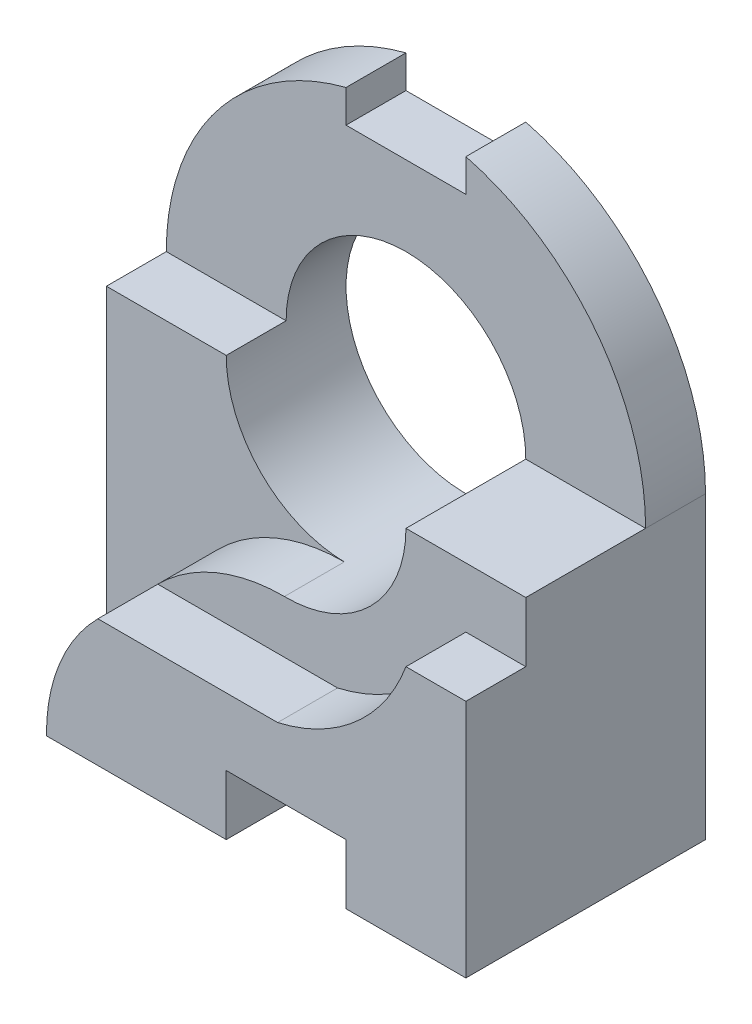
ISO-10303-21;
HEADER;
FILE_DESCRIPTION(('STEP AP214'),'2;1');
FILE_NAME('part.step','',(''),(''),'','','');
FILE_SCHEMA(('AUTOMOTIVE_DESIGN { 1 0 10303 214 1 1 1 1 }'));
ENDSEC;
DATA;
#1=APPLICATION_CONTEXT('core data for automotive mechanical design processes');
#2=APPLICATION_PROTOCOL_DEFINITION('international standard','automotive_design',2000,#1);
#3=PRODUCT_CONTEXT('',#1,'mechanical');
#4=PRODUCT('Part','Part','',(#3));
#5=PRODUCT_RELATED_PRODUCT_CATEGORY('part','',(#4));
#6=PRODUCT_DEFINITION_FORMATION('','',#4);
#7=PRODUCT_DEFINITION_CONTEXT('part definition',#1,'design');
#8=PRODUCT_DEFINITION('design','',#6,#7);
#9=PRODUCT_DEFINITION_SHAPE('','',#8);
#10=(LENGTH_UNIT() NAMED_UNIT(*) SI_UNIT(.MILLI.,.METRE.));
#11=(NAMED_UNIT(*) PLANE_ANGLE_UNIT() SI_UNIT($,.RADIAN.));
#12=(NAMED_UNIT(*) SI_UNIT($,.STERADIAN.) SOLID_ANGLE_UNIT());
#13=UNCERTAINTY_MEASURE_WITH_UNIT(LENGTH_MEASURE(1.E-05),#10,'distance_accuracy_value','');
#14=(GEOMETRIC_REPRESENTATION_CONTEXT(3) GLOBAL_UNCERTAINTY_ASSIGNED_CONTEXT((#13)) GLOBAL_UNIT_ASSIGNED_CONTEXT((#10,
#11,#12)) REPRESENTATION_CONTEXT('',''));
#15=CARTESIAN_POINT('',(0.,0.,0.));
#16=DIRECTION('',(0.,0.,1.));
#17=DIRECTION('',(1.,0.,0.));
#18=AXIS2_PLACEMENT_3D('',#15,#16,#17);
#19=CARTESIAN_POINT('',(0.,0.,4.));
#20=DIRECTION('',(0.,0.,-1.));
#21=DIRECTION('',(-1.,0.,0.));
#22=AXIS2_PLACEMENT_3D('',#19,#20,#21);
#23=CYLINDRICAL_SURFACE('',#22,2.);
#24=CARTESIAN_POINT('',(0.,0.,0.));
#25=DIRECTION('',(0.,0.,1.));
#26=DIRECTION('',(1.,0.,0.));
#27=AXIS2_PLACEMENT_3D('',#24,#25,#26);
#28=CIRCLE('',#27,2.);
#29=CARTESIAN_POINT('',(2.,0.,0.));
#30=VERTEX_POINT('',#29);
#31=EDGE_CURVE('E294',#30,#30,#28,.T.);
#32=ORIENTED_EDGE('',*,*,#31,.F.);
#33=EDGE_LOOP('',(#32));
#34=FACE_BOUND('',#33,.T.);
#35=DIRECTION('',(0.,0.,1.));
#36=VECTOR('',#35,1.);
#37=CARTESIAN_POINT('',(-0.0288487824081157,-1.99979192611471,2.));
#38=LINE('',#37,#36);
#39=CARTESIAN_POINT('',(-0.0288487824081157,-1.99979192611471,2.));
#40=VERTEX_POINT('',#39);
#41=CARTESIAN_POINT('',(-0.0288487824081157,-1.99979192611471,3.));
#42=VERTEX_POINT('',#41);
#43=EDGE_CURVE('E229',#40,#42,#38,.T.);
#44=ORIENTED_EDGE('',*,*,#43,.T.);
#45=CARTESIAN_POINT('',(0.,0.,3.));
#46=DIRECTION('',(0.,0.,1.));
#47=DIRECTION('',(1.,0.,0.));
#48=AXIS2_PLACEMENT_3D('',#45,#46,#47);
#49=CIRCLE('',#48,2.);
#50=CARTESIAN_POINT('',(2.,0.,3.));
#51=VERTEX_POINT('',#50);
#52=EDGE_CURVE('E48',#51,#42,#49,.F.);
#53=ORIENTED_EDGE('',*,*,#52,.F.);
#54=DIRECTION('',(0.,0.,-1.));
#55=VECTOR('',#54,1.);
#56=CARTESIAN_POINT('',(2.,0.,4.));
#57=LINE('',#56,#55);
#58=CARTESIAN_POINT('',(2.,0.,1.));
#59=VERTEX_POINT('',#58);
#60=EDGE_CURVE('E41',#59,#51,#57,.F.);
#61=ORIENTED_EDGE('',*,*,#60,.F.);
#62=CARTESIAN_POINT('',(0.,0.,1.));
#63=DIRECTION('',(0.,0.,-1.));
#64=DIRECTION('',(-1.,0.,0.));
#65=AXIS2_PLACEMENT_3D('',#62,#63,#64);
#66=CIRCLE('',#65,2.);
#67=CARTESIAN_POINT('',(-2.,0.,1.));
#68=VERTEX_POINT('',#67);
#69=EDGE_CURVE('E249',#68,#59,#66,.T.);
#70=ORIENTED_EDGE('',*,*,#69,.F.);
#71=DIRECTION('',(0.,0.,-1.));
#72=VECTOR('',#71,1.);
#73=CARTESIAN_POINT('',(-2.,0.,4.));
#74=LINE('',#73,#72);
#75=CARTESIAN_POINT('',(-2.,0.,2.));
#76=VERTEX_POINT('',#75);
#77=EDGE_CURVE('E11',#76,#68,#74,.T.);
#78=ORIENTED_EDGE('',*,*,#77,.F.);
#79=CARTESIAN_POINT('',(0.,0.,2.));
#80=DIRECTION('',(0.,0.,1.));
#81=DIRECTION('',(1.,0.,0.));
#82=AXIS2_PLACEMENT_3D('',#79,#80,#81);
#83=CIRCLE('',#82,2.);
#84=EDGE_CURVE('E56',#40,#76,#83,.F.);
#85=ORIENTED_EDGE('',*,*,#84,.F.);
#86=EDGE_LOOP('',(#44,#53,#61,#70,#78,#85));
#87=FACE_BOUND('',#86,.T.);
#88=ADVANCED_FACE('F33',(#34,#87),#23,.F.);
#89=CARTESIAN_POINT('',(4.,-5.,4.));
#90=DIRECTION('',(-1.,0.,0.));
#91=DIRECTION('',(0.,0.,1.));
#92=AXIS2_PLACEMENT_3D('',#89,#90,#91);
#93=PLANE('',#92);
#94=DIRECTION('',(0.,0.,1.));
#95=VECTOR('',#94,1.);
#96=CARTESIAN_POINT('',(4.,-1.,3.));
#97=LINE('',#96,#95);
#98=CARTESIAN_POINT('',(4.,-1.,3.));
#99=VERTEX_POINT('',#98);
#100=CARTESIAN_POINT('',(4.,-1.,4.));
#101=VERTEX_POINT('',#100);
#102=EDGE_CURVE('E181',#99,#101,#97,.T.);
#103=ORIENTED_EDGE('',*,*,#102,.T.);
#104=DIRECTION('',(0.,1.,0.));
#105=VECTOR('',#104,1.);
#106=CARTESIAN_POINT('',(4.,-5.,4.));
#107=LINE('',#106,#105);
#108=CARTESIAN_POINT('',(4.,-5.,4.));
#109=VERTEX_POINT('',#108);
#110=EDGE_CURVE('E303',#109,#101,#107,.T.);
#111=ORIENTED_EDGE('',*,*,#110,.F.);
#112=DIRECTION('',(0.,0.,-1.));
#113=VECTOR('',#112,1.);
#114=CARTESIAN_POINT('',(4.,-5.,4.));
#115=LINE('',#114,#113);
#116=CARTESIAN_POINT('',(4.,-5.,0.));
#117=VERTEX_POINT('',#116);
#118=EDGE_CURVE('E310',#109,#117,#115,.T.);
#119=ORIENTED_EDGE('',*,*,#118,.T.);
#120=DIRECTION('',(0.,1.,0.));
#121=VECTOR('',#120,1.);
#122=CARTESIAN_POINT('',(4.,-5.,0.));
#123=LINE('',#122,#121);
#124=CARTESIAN_POINT('',(4.,0.,0.));
#125=VERTEX_POINT('',#124);
#126=EDGE_CURVE('E302',#117,#125,#123,.T.);
#127=ORIENTED_EDGE('',*,*,#126,.T.);
#128=DIRECTION('',(0.,0.,-1.));
#129=VECTOR('',#128,1.);
#130=CARTESIAN_POINT('',(4.,0.,4.));
#131=LINE('',#130,#129);
#132=CARTESIAN_POINT('',(4.,0.,1.));
#133=VERTEX_POINT('',#132);
#134=EDGE_CURVE('E330',#133,#125,#131,.T.);
#135=ORIENTED_EDGE('',*,*,#134,.F.);
#136=CARTESIAN_POINT('',(4.,0.,3.));
#137=VERTEX_POINT('',#136);
#138=EDGE_CURVE('E331',#137,#133,#131,.T.);
#139=ORIENTED_EDGE('',*,*,#138,.F.);
#140=DIRECTION('',(0.,1.,0.));
#141=VECTOR('',#140,1.);
#142=CARTESIAN_POINT('',(4.,0.,3.));
#143=LINE('',#142,#141);
#144=EDGE_CURVE('E184',#99,#137,#143,.T.);
#145=ORIENTED_EDGE('',*,*,#144,.F.);
#146=EDGE_LOOP('',(#103,#111,#119,#127,#135,#139,#145));
#147=FACE_BOUND('',#146,.T.);
#148=ADVANCED_FACE('F35',(#147),#93,.F.);
#149=CARTESIAN_POINT('',(4.,0.,1.));
#150=DIRECTION('',(0.,-1.,0.));
#151=DIRECTION('',(1.,0.,0.));
#152=AXIS2_PLACEMENT_3D('',#149,#150,#151);
#153=PLANE('',#152);
#154=DIRECTION('',(-1.,0.,0.));
#155=VECTOR('',#154,1.);
#156=CARTESIAN_POINT('',(0.,0.,3.));
#157=LINE('',#156,#155);
#158=EDGE_CURVE('E205',#137,#51,#157,.T.);
#159=ORIENTED_EDGE('',*,*,#158,.F.);
#160=ORIENTED_EDGE('',*,*,#138,.T.);
#161=DIRECTION('',(1.,0.,0.));
#162=VECTOR('',#161,1.);
#163=CARTESIAN_POINT('',(4.,0.,1.));
#164=LINE('',#163,#162);
#165=EDGE_CURVE('E239',#59,#133,#164,.T.);
#166=ORIENTED_EDGE('',*,*,#165,.F.);
#167=ORIENTED_EDGE('',*,*,#60,.T.);
#168=EDGE_LOOP('',(#159,#160,#166,#167));
#169=FACE_BOUND('',#168,.T.);
#170=ADVANCED_FACE('F340',(#169),#153,.F.);
#171=CARTESIAN_POINT('',(4.,-5.,4.));
#172=DIRECTION('',(0.,1.,0.));
#173=DIRECTION('',(-1.,0.,0.));
#174=AXIS2_PLACEMENT_3D('',#171,#172,#173);
#175=PLANE('',#174);
#176=DIRECTION('',(0.,0.,1.));
#177=VECTOR('',#176,1.);
#178=CARTESIAN_POINT('',(-3.,-5.,2.));
#179=LINE('',#178,#177);
#180=CARTESIAN_POINT('',(-3.,-5.,2.));
#181=VERTEX_POINT('',#180);
#182=CARTESIAN_POINT('',(-3.,-5.,4.));
#183=VERTEX_POINT('',#182);
#184=EDGE_CURVE('E231',#181,#183,#179,.T.);
#185=ORIENTED_EDGE('',*,*,#184,.F.);
#186=DIRECTION('',(1.,0.,0.));
#187=VECTOR('',#186,1.);
#188=CARTESIAN_POINT('',(0.,-5.,2.));
#189=LINE('',#188,#187);
#190=CARTESIAN_POINT('',(-4.,-5.,2.));
#191=VERTEX_POINT('',#190);
#192=EDGE_CURVE('E226',#191,#181,#189,.T.);
#193=ORIENTED_EDGE('',*,*,#192,.F.);
#194=DIRECTION('',(0.,0.,-1.));
#195=VECTOR('',#194,1.);
#196=CARTESIAN_POINT('',(-4.,-5.,4.));
#197=LINE('',#196,#195);
#198=CARTESIAN_POINT('',(-4.,-5.,0.));
#199=VERTEX_POINT('',#198);
#200=EDGE_CURVE('E325',#191,#199,#197,.T.);
#201=ORIENTED_EDGE('',*,*,#200,.T.);
#202=DIRECTION('',(1.,0.,0.));
#203=VECTOR('',#202,1.);
#204=CARTESIAN_POINT('',(4.,-5.,0.));
#205=LINE('',#204,#203);
#206=CARTESIAN_POINT('',(0.,-5.,0.));
#207=VERTEX_POINT('',#206);
#208=EDGE_CURVE('E307',#199,#207,#205,.T.);
#209=ORIENTED_EDGE('',*,*,#208,.T.);
#210=DIRECTION('',(0.,0.,1.));
#211=VECTOR('',#210,1.);
#212=CARTESIAN_POINT('',(0.,-5.,0.));
#213=LINE('',#212,#211);
#214=CARTESIAN_POINT('',(0.,-5.,4.));
#215=VERTEX_POINT('',#214);
#216=EDGE_CURVE('E291',#207,#215,#213,.T.);
#217=ORIENTED_EDGE('',*,*,#216,.T.);
#218=DIRECTION('',(1.,0.,0.));
#219=VECTOR('',#218,1.);
#220=CARTESIAN_POINT('',(4.,-5.,4.));
#221=LINE('',#220,#219);
#222=EDGE_CURVE('E308',#183,#215,#221,.T.);
#223=ORIENTED_EDGE('',*,*,#222,.F.);
#224=EDGE_LOOP('',(#185,#193,#201,#209,#217,#223));
#225=FACE_BOUND('',#224,.T.);
#226=ADVANCED_FACE('F356',(#225),#175,.F.);
#227=CARTESIAN_POINT('',(0.,0.,4.));
#228=DIRECTION('',(0.,0.,-1.));
#229=DIRECTION('',(-1.,0.,0.));
#230=AXIS2_PLACEMENT_3D('',#227,#228,#229);
#231=PLANE('',#230);
#232=CARTESIAN_POINT('',(0.188280895426578,0.0460572054036203,4.));
#233=DIRECTION('',(0.,0.,1.));
#234=DIRECTION('',(1.,0.,0.));
#235=AXIS2_PLACEMENT_3D('',#232,#233,#234);
#236=CIRCLE('',#235,3.);
#237=CARTESIAN_POINT('',(3.,-1.,4.));
#238=VERTEX_POINT('',#237);
#239=CARTESIAN_POINT('',(0.85786479395321,-2.87826449421048,4.));
#240=VERTEX_POINT('',#239);
#241=EDGE_CURVE('E191',#238,#240,#236,.F.);
#242=ORIENTED_EDGE('',*,*,#241,.T.);
#243=DIRECTION('',(1.,0.,0.));
#244=VECTOR('',#243,1.);
#245=CARTESIAN_POINT('',(0.,-2.87826449421048,4.));
#246=LINE('',#245,#244);
#247=CARTESIAN_POINT('',(-2.14213520604679,-2.87826449421048,4.));
#248=VERTEX_POINT('',#247);
#249=EDGE_CURVE('E198',#248,#240,#246,.T.);
#250=ORIENTED_EDGE('',*,*,#249,.F.);
#251=CARTESIAN_POINT('',(-0.0358046106557674,-4.96419538934423,4.));
#252=DIRECTION('',(0.,0.,1.));
#253=DIRECTION('',(1.,0.,0.));
#254=AXIS2_PLACEMENT_3D('',#251,#252,#253);
#255=CIRCLE('',#254,2.96441162397428);
#256=EDGE_CURVE('E215',#248,#183,#255,.T.);
#257=ORIENTED_EDGE('',*,*,#256,.T.);
#258=ORIENTED_EDGE('',*,*,#222,.T.);
#259=DIRECTION('',(0.,-1.,0.));
#260=VECTOR('',#259,1.);
#261=CARTESIAN_POINT('',(0.,-4.,4.));
#262=LINE('',#261,#260);
#263=CARTESIAN_POINT('',(0.,-4.,4.));
#264=VERTEX_POINT('',#263);
#265=EDGE_CURVE('E277',#264,#215,#262,.T.);
#266=ORIENTED_EDGE('',*,*,#265,.F.);
#267=DIRECTION('',(-1.,0.,0.));
#268=VECTOR('',#267,1.);
#269=CARTESIAN_POINT('',(2.,-4.,4.));
#270=LINE('',#269,#268);
#271=CARTESIAN_POINT('',(2.,-4.,4.));
#272=VERTEX_POINT('',#271);
#273=EDGE_CURVE('E286',#272,#264,#270,.T.);
#274=ORIENTED_EDGE('',*,*,#273,.F.);
#275=DIRECTION('',(0.,1.,0.));
#276=VECTOR('',#275,1.);
#277=CARTESIAN_POINT('',(2.,-5.,4.));
#278=LINE('',#277,#276);
#279=CARTESIAN_POINT('',(2.,-5.,4.));
#280=VERTEX_POINT('',#279);
#281=EDGE_CURVE('E264',#280,#272,#278,.T.);
#282=ORIENTED_EDGE('',*,*,#281,.F.);
#283=EDGE_CURVE('E306',#280,#109,#221,.T.);
#284=ORIENTED_EDGE('',*,*,#283,.T.);
#285=ORIENTED_EDGE('',*,*,#110,.T.);
#286=DIRECTION('',(-1.,0.,0.));
#287=VECTOR('',#286,1.);
#288=CARTESIAN_POINT('',(0.,-0.999999999999999,4.));
#289=LINE('',#288,#287);
#290=EDGE_CURVE('E201',#101,#238,#289,.T.);
#291=ORIENTED_EDGE('',*,*,#290,.T.);
#292=EDGE_LOOP('',(#242,#250,#257,#258,#266,#274,#282,#284,#285,#291));
#293=FACE_BOUND('',#292,.T.);
#294=ADVANCED_FACE('F360',(#293),#231,.F.);
#295=CARTESIAN_POINT('',(-4.,-5.,4.));
#296=DIRECTION('',(1.,0.,0.));
#297=DIRECTION('',(0.,0.,-1.));
#298=AXIS2_PLACEMENT_3D('',#295,#296,#297);
#299=PLANE('',#298);
#300=DIRECTION('',(0.,-1.,0.));
#301=VECTOR('',#300,1.);
#302=CARTESIAN_POINT('',(-4.,0.,2.));
#303=LINE('',#302,#301);
#304=CARTESIAN_POINT('',(-4.,0.,2.));
#305=VERTEX_POINT('',#304);
#306=EDGE_CURVE('E224',#305,#191,#303,.T.);
#307=ORIENTED_EDGE('',*,*,#306,.F.);
#308=DIRECTION('',(0.,0.,-1.));
#309=VECTOR('',#308,1.);
#310=CARTESIAN_POINT('',(-4.,0.,4.));
#311=LINE('',#310,#309);
#312=CARTESIAN_POINT('',(-4.,0.,1.));
#313=VERTEX_POINT('',#312);
#314=EDGE_CURVE('E328',#305,#313,#311,.T.);
#315=ORIENTED_EDGE('',*,*,#314,.T.);
#316=CARTESIAN_POINT('',(-4.,0.,0.));
#317=VERTEX_POINT('',#316);
#318=EDGE_CURVE('E327',#313,#317,#311,.T.);
#319=ORIENTED_EDGE('',*,*,#318,.T.);
#320=DIRECTION('',(0.,-1.,0.));
#321=VECTOR('',#320,1.);
#322=CARTESIAN_POINT('',(-4.,-5.,0.));
#323=LINE('',#322,#321);
#324=EDGE_CURVE('E317',#317,#199,#323,.T.);
#325=ORIENTED_EDGE('',*,*,#324,.T.);
#326=ORIENTED_EDGE('',*,*,#200,.F.);
#327=EDGE_LOOP('',(#307,#315,#319,#325,#326));
#328=FACE_BOUND('',#327,.T.);
#329=ADVANCED_FACE('F387',(#328),#299,.F.);
#330=DIRECTION('',(-1.,0.,0.));
#331=VECTOR('',#330,1.);
#332=CARTESIAN_POINT('',(0.,0.,2.));
#333=LINE('',#332,#331);
#334=EDGE_CURVE('E222',#76,#305,#333,.T.);
#335=ORIENTED_EDGE('',*,*,#334,.F.);
#336=ORIENTED_EDGE('',*,*,#77,.T.);
#337=EDGE_CURVE('E240',#313,#68,#164,.T.);
#338=ORIENTED_EDGE('',*,*,#337,.F.);
#339=ORIENTED_EDGE('',*,*,#314,.F.);
#340=EDGE_LOOP('',(#335,#336,#338,#339));
#341=FACE_BOUND('',#340,.T.);
#342=ADVANCED_FACE('F400',(#341),#153,.F.);
#343=CARTESIAN_POINT('',(0.,0.,4.));
#344=DIRECTION('',(0.,0.,-1.));
#345=DIRECTION('',(-1.,0.,0.));
#346=AXIS2_PLACEMENT_3D('',#343,#344,#345);
#347=CYLINDRICAL_SURFACE('',#346,4.);
#348=DIRECTION('',(0.,0.,1.));
#349=VECTOR('',#348,1.);
#350=CARTESIAN_POINT('',(1.,3.87298334620742,0.));
#351=LINE('',#350,#349);
#352=CARTESIAN_POINT('',(1.,3.87298334620742,0.));
#353=VERTEX_POINT('',#352);
#354=CARTESIAN_POINT('',(1.,3.87298334620742,1.));
#355=VERTEX_POINT('',#354);
#356=EDGE_CURVE('E260',#353,#355,#351,.T.);
#357=ORIENTED_EDGE('',*,*,#356,.T.);
#358=CARTESIAN_POINT('',(0.,0.,1.));
#359=DIRECTION('',(0.,0.,1.));
#360=DIRECTION('',(-1.,0.,0.));
#361=AXIS2_PLACEMENT_3D('',#358,#359,#360);
#362=CIRCLE('',#361,4.);
#363=EDGE_CURVE('E237',#133,#355,#362,.T.);
#364=ORIENTED_EDGE('',*,*,#363,.F.);
#365=ORIENTED_EDGE('',*,*,#134,.T.);
#366=CARTESIAN_POINT('',(0.,0.,0.));
#367=DIRECTION('',(0.,0.,1.));
#368=DIRECTION('',(-1.,0.,0.));
#369=AXIS2_PLACEMENT_3D('',#366,#367,#368);
#370=CIRCLE('',#369,4.);
#371=EDGE_CURVE('E314',#125,#353,#370,.T.);
#372=ORIENTED_EDGE('',*,*,#371,.T.);
#373=EDGE_LOOP('',(#357,#364,#365,#372));
#374=FACE_BOUND('',#373,.T.);
#375=ADVANCED_FACE('F392',(#374),#347,.T.);
#376=CARTESIAN_POINT('',(0.,0.,0.));
#377=DIRECTION('',(0.,0.,-1.));
#378=DIRECTION('',(-1.,0.,0.));
#379=AXIS2_PLACEMENT_3D('',#376,#377,#378);
#380=PLANE('',#379);
#381=DIRECTION('',(0.,1.,0.));
#382=VECTOR('',#381,1.);
#383=CARTESIAN_POINT('',(1.,3.3278264315435,0.));
#384=LINE('',#383,#382);
#385=CARTESIAN_POINT('',(1.,3.3278264315435,0.));
#386=VERTEX_POINT('',#385);
#387=EDGE_CURVE('E251',#386,#353,#384,.T.);
#388=ORIENTED_EDGE('',*,*,#387,.T.);
#389=ORIENTED_EDGE('',*,*,#371,.F.);
#390=ORIENTED_EDGE('',*,*,#126,.F.);
#391=CARTESIAN_POINT('',(2.,-5.,0.));
#392=VERTEX_POINT('',#391);
#393=EDGE_CURVE('E320',#392,#117,#205,.T.);
#394=ORIENTED_EDGE('',*,*,#393,.F.);
#395=DIRECTION('',(0.,1.,0.));
#396=VECTOR('',#395,1.);
#397=CARTESIAN_POINT('',(2.,-5.,0.));
#398=LINE('',#397,#396);
#399=CARTESIAN_POINT('',(2.,-4.,0.));
#400=VERTEX_POINT('',#399);
#401=EDGE_CURVE('E273',#392,#400,#398,.T.);
#402=ORIENTED_EDGE('',*,*,#401,.T.);
#403=DIRECTION('',(-1.,0.,0.));
#404=VECTOR('',#403,1.);
#405=CARTESIAN_POINT('',(2.,-4.,0.));
#406=LINE('',#405,#404);
#407=CARTESIAN_POINT('',(0.,-4.,0.));
#408=VERTEX_POINT('',#407);
#409=EDGE_CURVE('E276',#400,#408,#406,.T.);
#410=ORIENTED_EDGE('',*,*,#409,.T.);
#411=DIRECTION('',(0.,-1.,0.));
#412=VECTOR('',#411,1.);
#413=CARTESIAN_POINT('',(0.,-4.,0.));
#414=LINE('',#413,#412);
#415=EDGE_CURVE('E280',#408,#207,#414,.T.);
#416=ORIENTED_EDGE('',*,*,#415,.T.);
#417=ORIENTED_EDGE('',*,*,#208,.F.);
#418=ORIENTED_EDGE('',*,*,#324,.F.);
#419=CARTESIAN_POINT('',(-1.,3.87298334620742,0.));
#420=VERTEX_POINT('',#419);
#421=EDGE_CURVE('E313',#420,#317,#370,.T.);
#422=ORIENTED_EDGE('',*,*,#421,.F.);
#423=DIRECTION('',(0.,-1.,0.));
#424=VECTOR('',#423,1.);
#425=CARTESIAN_POINT('',(-1.,3.3278264315435,0.));
#426=LINE('',#425,#424);
#427=CARTESIAN_POINT('',(-1.,3.3278264315435,0.));
#428=VERTEX_POINT('',#427);
#429=EDGE_CURVE('E254',#420,#428,#426,.T.);
#430=ORIENTED_EDGE('',*,*,#429,.T.);
#431=DIRECTION('',(1.,0.,0.));
#432=VECTOR('',#431,1.);
#433=CARTESIAN_POINT('',(1.,3.3278264315435,0.));
#434=LINE('',#433,#432);
#435=EDGE_CURVE('E257',#428,#386,#434,.T.);
#436=ORIENTED_EDGE('',*,*,#435,.T.);
#437=EDGE_LOOP('',(#388,#389,#390,#394,#402,#410,#416,#417,#418,#422,#430,#436));
#438=FACE_BOUND('',#437,.T.);
#439=ORIENTED_EDGE('',*,*,#31,.T.);
#440=EDGE_LOOP('',(#439));
#441=FACE_BOUND('',#440,.T.);
#442=ADVANCED_FACE('F388',(#438,#441),#380,.T.);
#443=ORIENTED_EDGE('',*,*,#318,.F.);
#444=CARTESIAN_POINT('',(-1.,3.87298334620742,1.));
#445=VERTEX_POINT('',#444);
#446=EDGE_CURVE('E234',#445,#313,#362,.T.);
#447=ORIENTED_EDGE('',*,*,#446,.F.);
#448=DIRECTION('',(0.,0.,1.));
#449=VECTOR('',#448,1.);
#450=CARTESIAN_POINT('',(-1.,3.87298334620742,0.));
#451=LINE('',#450,#449);
#452=EDGE_CURVE('E268',#420,#445,#451,.T.);
#453=ORIENTED_EDGE('',*,*,#452,.F.);
#454=ORIENTED_EDGE('',*,*,#421,.T.);
#455=EDGE_LOOP('',(#443,#447,#453,#454));
#456=FACE_BOUND('',#455,.T.);
#457=ADVANCED_FACE('F391',(#456),#347,.T.);
#458=ORIENTED_EDGE('',*,*,#283,.F.);
#459=DIRECTION('',(0.,0.,1.));
#460=VECTOR('',#459,1.);
#461=CARTESIAN_POINT('',(2.,-5.,0.));
#462=LINE('',#461,#460);
#463=EDGE_CURVE('E283',#392,#280,#462,.T.);
#464=ORIENTED_EDGE('',*,*,#463,.F.);
#465=ORIENTED_EDGE('',*,*,#393,.T.);
#466=ORIENTED_EDGE('',*,*,#118,.F.);
#467=EDGE_LOOP('',(#458,#464,#465,#466));
#468=FACE_BOUND('',#467,.T.);
#469=ADVANCED_FACE('F394',(#468),#175,.F.);
#470=CARTESIAN_POINT('',(0.,-4.,0.));
#471=DIRECTION('',(-1.,0.,0.));
#472=DIRECTION('',(0.,0.,1.));
#473=AXIS2_PLACEMENT_3D('',#470,#471,#472);
#474=PLANE('',#473);
#475=ORIENTED_EDGE('',*,*,#265,.T.);
#476=ORIENTED_EDGE('',*,*,#216,.F.);
#477=ORIENTED_EDGE('',*,*,#415,.F.);
#478=DIRECTION('',(0.,0.,1.));
#479=VECTOR('',#478,1.);
#480=CARTESIAN_POINT('',(0.,-4.,0.));
#481=LINE('',#480,#479);
#482=EDGE_CURVE('E295',#408,#264,#481,.T.);
#483=ORIENTED_EDGE('',*,*,#482,.T.);
#484=EDGE_LOOP('',(#475,#476,#477,#483));
#485=FACE_BOUND('',#484,.T.);
#486=ADVANCED_FACE('F397',(#485),#474,.F.);
#487=CARTESIAN_POINT('',(2.,-4.,0.));
#488=DIRECTION('',(0.,1.,0.));
#489=DIRECTION('',(0.,0.,1.));
#490=AXIS2_PLACEMENT_3D('',#487,#488,#489);
#491=PLANE('',#490);
#492=ORIENTED_EDGE('',*,*,#273,.T.);
#493=ORIENTED_EDGE('',*,*,#482,.F.);
#494=ORIENTED_EDGE('',*,*,#409,.F.);
#495=DIRECTION('',(0.,0.,1.));
#496=VECTOR('',#495,1.);
#497=CARTESIAN_POINT('',(2.,-4.,0.));
#498=LINE('',#497,#496);
#499=EDGE_CURVE('E297',#400,#272,#498,.T.);
#500=ORIENTED_EDGE('',*,*,#499,.T.);
#501=EDGE_LOOP('',(#492,#493,#494,#500));
#502=FACE_BOUND('',#501,.T.);
#503=ADVANCED_FACE('F443',(#502),#491,.F.);
#504=CARTESIAN_POINT('',(2.,-5.,0.));
#505=DIRECTION('',(1.,0.,0.));
#506=DIRECTION('',(0.,0.,-1.));
#507=AXIS2_PLACEMENT_3D('',#504,#505,#506);
#508=PLANE('',#507);
#509=ORIENTED_EDGE('',*,*,#281,.T.);
#510=ORIENTED_EDGE('',*,*,#499,.F.);
#511=ORIENTED_EDGE('',*,*,#401,.F.);
#512=ORIENTED_EDGE('',*,*,#463,.T.);
#513=EDGE_LOOP('',(#509,#510,#511,#512));
#514=FACE_BOUND('',#513,.T.);
#515=ADVANCED_FACE('F383',(#514),#508,.F.);
#516=CARTESIAN_POINT('',(1.,3.3278264315435,0.));
#517=DIRECTION('',(1.,0.,0.));
#518=DIRECTION('',(0.,0.,-1.));
#519=AXIS2_PLACEMENT_3D('',#516,#517,#518);
#520=PLANE('',#519);
#521=DIRECTION('',(0.,0.,1.));
#522=VECTOR('',#521,1.);
#523=CARTESIAN_POINT('',(1.,3.3278264315435,0.));
#524=LINE('',#523,#522);
#525=CARTESIAN_POINT('',(1.,3.3278264315435,1.));
#526=VERTEX_POINT('',#525);
#527=EDGE_CURVE('E261',#386,#526,#524,.T.);
#528=ORIENTED_EDGE('',*,*,#527,.T.);
#529=DIRECTION('',(0.,1.,0.));
#530=VECTOR('',#529,1.);
#531=CARTESIAN_POINT('',(1.,3.3278264315435,1.));
#532=LINE('',#531,#530);
#533=EDGE_CURVE('E246',#526,#355,#532,.T.);
#534=ORIENTED_EDGE('',*,*,#533,.T.);
#535=ORIENTED_EDGE('',*,*,#356,.F.);
#536=ORIENTED_EDGE('',*,*,#387,.F.);
#537=EDGE_LOOP('',(#528,#534,#535,#536));
#538=FACE_BOUND('',#537,.T.);
#539=ADVANCED_FACE('F419',(#538),#520,.F.);
#540=CARTESIAN_POINT('',(1.,3.3278264315435,0.));
#541=DIRECTION('',(0.,-1.,0.));
#542=DIRECTION('',(0.,0.,-1.));
#543=AXIS2_PLACEMENT_3D('',#540,#541,#542);
#544=PLANE('',#543);
#545=DIRECTION('',(0.,0.,1.));
#546=VECTOR('',#545,1.);
#547=CARTESIAN_POINT('',(-1.,3.3278264315435,0.));
#548=LINE('',#547,#546);
#549=CARTESIAN_POINT('',(-1.,3.3278264315435,1.));
#550=VERTEX_POINT('',#549);
#551=EDGE_CURVE('E265',#428,#550,#548,.T.);
#552=ORIENTED_EDGE('',*,*,#551,.T.);
#553=DIRECTION('',(1.,0.,0.));
#554=VECTOR('',#553,1.);
#555=CARTESIAN_POINT('',(1.,3.3278264315435,1.));
#556=LINE('',#555,#554);
#557=EDGE_CURVE('E243',#550,#526,#556,.T.);
#558=ORIENTED_EDGE('',*,*,#557,.T.);
#559=ORIENTED_EDGE('',*,*,#527,.F.);
#560=ORIENTED_EDGE('',*,*,#435,.F.);
#561=EDGE_LOOP('',(#552,#558,#559,#560));
#562=FACE_BOUND('',#561,.T.);
#563=ADVANCED_FACE('F425',(#562),#544,.F.);
#564=CARTESIAN_POINT('',(-1.,3.3278264315435,0.));
#565=DIRECTION('',(-1.,0.,0.));
#566=DIRECTION('',(0.,0.,1.));
#567=AXIS2_PLACEMENT_3D('',#564,#565,#566);
#568=PLANE('',#567);
#569=ORIENTED_EDGE('',*,*,#452,.T.);
#570=DIRECTION('',(0.,-1.,0.));
#571=VECTOR('',#570,1.);
#572=CARTESIAN_POINT('',(-1.,3.3278264315435,1.));
#573=LINE('',#572,#571);
#574=EDGE_CURVE('E333',#445,#550,#573,.T.);
#575=ORIENTED_EDGE('',*,*,#574,.T.);
#576=ORIENTED_EDGE('',*,*,#551,.F.);
#577=ORIENTED_EDGE('',*,*,#429,.F.);
#578=EDGE_LOOP('',(#569,#575,#576,#577));
#579=FACE_BOUND('',#578,.T.);
#580=ADVANCED_FACE('F431',(#579),#568,.F.);
#581=CARTESIAN_POINT('',(0.,0.,1.));
#582=DIRECTION('',(0.,0.,-1.));
#583=DIRECTION('',(-1.,0.,0.));
#584=AXIS2_PLACEMENT_3D('',#581,#582,#583);
#585=PLANE('',#584);
#586=ORIENTED_EDGE('',*,*,#69,.T.);
#587=ORIENTED_EDGE('',*,*,#165,.T.);
#588=ORIENTED_EDGE('',*,*,#363,.T.);
#589=ORIENTED_EDGE('',*,*,#533,.F.);
#590=ORIENTED_EDGE('',*,*,#557,.F.);
#591=ORIENTED_EDGE('',*,*,#574,.F.);
#592=ORIENTED_EDGE('',*,*,#446,.T.);
#593=ORIENTED_EDGE('',*,*,#337,.T.);
#594=EDGE_LOOP('',(#586,#587,#588,#589,#590,#591,#592,#593));
#595=FACE_BOUND('',#594,.T.);
#596=ADVANCED_FACE('F427',(#595),#585,.F.);
#597=CARTESIAN_POINT('',(-0.0358046106557674,-4.96419538934423,2.));
#598=DIRECTION('',(0.,0.,1.));
#599=DIRECTION('',(1.,0.,0.));
#600=AXIS2_PLACEMENT_3D('',#597,#598,#599);
#601=CYLINDRICAL_SURFACE('',#600,2.96441162397428);
#602=DIRECTION('',(0.,0.,1.));
#603=VECTOR('',#602,1.);
#604=CARTESIAN_POINT('',(-2.14213520604679,-2.87826449421048,3.));
#605=LINE('',#604,#603);
#606=CARTESIAN_POINT('',(-2.14213520604679,-2.87826449421048,3.));
#607=VERTEX_POINT('',#606);
#608=EDGE_CURVE('E216',#607,#248,#605,.T.);
#609=ORIENTED_EDGE('',*,*,#608,.F.);
#610=CARTESIAN_POINT('',(-0.0358046106557674,-4.96419538934423,3.));
#611=DIRECTION('',(0.,0.,1.));
#612=DIRECTION('',(1.,0.,0.));
#613=AXIS2_PLACEMENT_3D('',#610,#611,#612);
#614=CIRCLE('',#613,2.96441162397428);
#615=EDGE_CURVE('E208',#42,#607,#614,.T.);
#616=ORIENTED_EDGE('',*,*,#615,.F.);
#617=ORIENTED_EDGE('',*,*,#43,.F.);
#618=CARTESIAN_POINT('',(-0.0358046106557674,-4.96419538934423,2.));
#619=DIRECTION('',(0.,0.,1.));
#620=DIRECTION('',(1.,0.,0.));
#621=AXIS2_PLACEMENT_3D('',#618,#619,#620);
#622=CIRCLE('',#621,2.96441162397428);
#623=EDGE_CURVE('E219',#40,#181,#622,.T.);
#624=ORIENTED_EDGE('',*,*,#623,.T.);
#625=ORIENTED_EDGE('',*,*,#184,.T.);
#626=ORIENTED_EDGE('',*,*,#256,.F.);
#627=EDGE_LOOP('',(#609,#616,#617,#624,#625,#626));
#628=FACE_BOUND('',#627,.T.);
#629=ADVANCED_FACE('F348',(#628),#601,.T.);
#630=CARTESIAN_POINT('',(0.,0.,2.));
#631=DIRECTION('',(0.,0.,1.));
#632=DIRECTION('',(1.,0.,0.));
#633=AXIS2_PLACEMENT_3D('',#630,#631,#632);
#634=PLANE('',#633);
#635=ORIENTED_EDGE('',*,*,#623,.F.);
#636=ORIENTED_EDGE('',*,*,#84,.T.);
#637=ORIENTED_EDGE('',*,*,#334,.T.);
#638=ORIENTED_EDGE('',*,*,#306,.T.);
#639=ORIENTED_EDGE('',*,*,#192,.T.);
#640=EDGE_LOOP('',(#635,#636,#637,#638,#639));
#641=FACE_BOUND('',#640,.T.);
#642=ADVANCED_FACE('F349',(#641),#634,.T.);
#643=CARTESIAN_POINT('',(0.188280895426578,0.0460572054036203,3.));
#644=DIRECTION('',(0.,0.,1.));
#645=DIRECTION('',(1.,0.,0.));
#646=AXIS2_PLACEMENT_3D('',#643,#644,#645);
#647=CYLINDRICAL_SURFACE('',#646,3.);
#648=ORIENTED_EDGE('',*,*,#241,.F.);
#649=DIRECTION('',(0.,0.,1.));
#650=VECTOR('',#649,1.);
#651=CARTESIAN_POINT('',(3.,-1.,3.));
#652=LINE('',#651,#650);
#653=CARTESIAN_POINT('',(3.,-1.,3.));
#654=VERTEX_POINT('',#653);
#655=EDGE_CURVE('E178',#654,#238,#652,.T.);
#656=ORIENTED_EDGE('',*,*,#655,.F.);
#657=CARTESIAN_POINT('',(0.188280895426578,0.0460572054036203,3.));
#658=DIRECTION('',(0.,0.,1.));
#659=DIRECTION('',(1.,0.,0.));
#660=AXIS2_PLACEMENT_3D('',#657,#658,#659);
#661=CIRCLE('',#660,3.);
#662=CARTESIAN_POINT('',(0.85786479395321,-2.87826449421048,3.));
#663=VERTEX_POINT('',#662);
#664=EDGE_CURVE('E185',#654,#663,#661,.F.);
#665=ORIENTED_EDGE('',*,*,#664,.T.);
#666=DIRECTION('',(0.,0.,1.));
#667=VECTOR('',#666,1.);
#668=CARTESIAN_POINT('',(0.85786479395321,-2.87826449421048,3.));
#669=LINE('',#668,#667);
#670=EDGE_CURVE('E213',#663,#240,#669,.T.);
#671=ORIENTED_EDGE('',*,*,#670,.T.);
#672=EDGE_LOOP('',(#648,#656,#665,#671));
#673=FACE_BOUND('',#672,.T.);
#674=ADVANCED_FACE('F188',(#673),#647,.F.);
#675=CARTESIAN_POINT('',(0.,-2.87826449421048,3.));
#676=DIRECTION('',(0.,-1.,0.));
#677=DIRECTION('',(0.,0.,-1.));
#678=AXIS2_PLACEMENT_3D('',#675,#676,#677);
#679=PLANE('',#678);
#680=ORIENTED_EDGE('',*,*,#249,.T.);
#681=ORIENTED_EDGE('',*,*,#670,.F.);
#682=DIRECTION('',(1.,0.,0.));
#683=VECTOR('',#682,1.);
#684=CARTESIAN_POINT('',(0.,-2.87826449421048,3.));
#685=LINE('',#684,#683);
#686=EDGE_CURVE('E193',#607,#663,#685,.T.);
#687=ORIENTED_EDGE('',*,*,#686,.F.);
#688=ORIENTED_EDGE('',*,*,#608,.T.);
#689=EDGE_LOOP('',(#680,#681,#687,#688));
#690=FACE_BOUND('',#689,.T.);
#691=ADVANCED_FACE('F363',(#690),#679,.F.);
#692=CARTESIAN_POINT('',(0.,-0.999999999999999,3.));
#693=DIRECTION('',(0.,1.,0.));
#694=DIRECTION('',(-1.,0.,0.));
#695=AXIS2_PLACEMENT_3D('',#692,#693,#694);
#696=PLANE('',#695);
#697=ORIENTED_EDGE('',*,*,#290,.F.);
#698=ORIENTED_EDGE('',*,*,#102,.F.);
#699=DIRECTION('',(-1.,0.,0.));
#700=VECTOR('',#699,1.);
#701=CARTESIAN_POINT('',(0.,-0.999999999999999,3.));
#702=LINE('',#701,#700);
#703=EDGE_CURVE('E175',#99,#654,#702,.T.);
#704=ORIENTED_EDGE('',*,*,#703,.T.);
#705=ORIENTED_EDGE('',*,*,#655,.T.);
#706=EDGE_LOOP('',(#697,#698,#704,#705));
#707=FACE_BOUND('',#706,.T.);
#708=ADVANCED_FACE('F177',(#707),#696,.T.);
#709=CARTESIAN_POINT('',(0.,0.,3.));
#710=DIRECTION('',(0.,0.,1.));
#711=DIRECTION('',(1.,0.,0.));
#712=AXIS2_PLACEMENT_3D('',#709,#710,#711);
#713=PLANE('',#712);
#714=ORIENTED_EDGE('',*,*,#664,.F.);
#715=ORIENTED_EDGE('',*,*,#703,.F.);
#716=ORIENTED_EDGE('',*,*,#144,.T.);
#717=ORIENTED_EDGE('',*,*,#158,.T.);
#718=ORIENTED_EDGE('',*,*,#52,.T.);
#719=ORIENTED_EDGE('',*,*,#615,.T.);
#720=ORIENTED_EDGE('',*,*,#686,.T.);
#721=EDGE_LOOP('',(#714,#715,#716,#717,#718,#719,#720));
#722=FACE_BOUND('',#721,.T.);
#723=ADVANCED_FACE('F196',(#722),#713,.T.);
#724=CLOSED_SHELL('',(#88,#148,#170,#226,#294,#329,#342,#375,#442,#457,#469,#486,#503,#515,#539,
#563,#580,#596,#629,#642,#674,#691,#708,#723));
#725=MANIFOLD_SOLID_BREP('B2',#724);
#726=ADVANCED_BREP_SHAPE_REPRESENTATION('',(#18,#725),#14);
#727=SHAPE_DEFINITION_REPRESENTATION(#9,#726);
ENDSEC;
END-ISO-10303-21;
